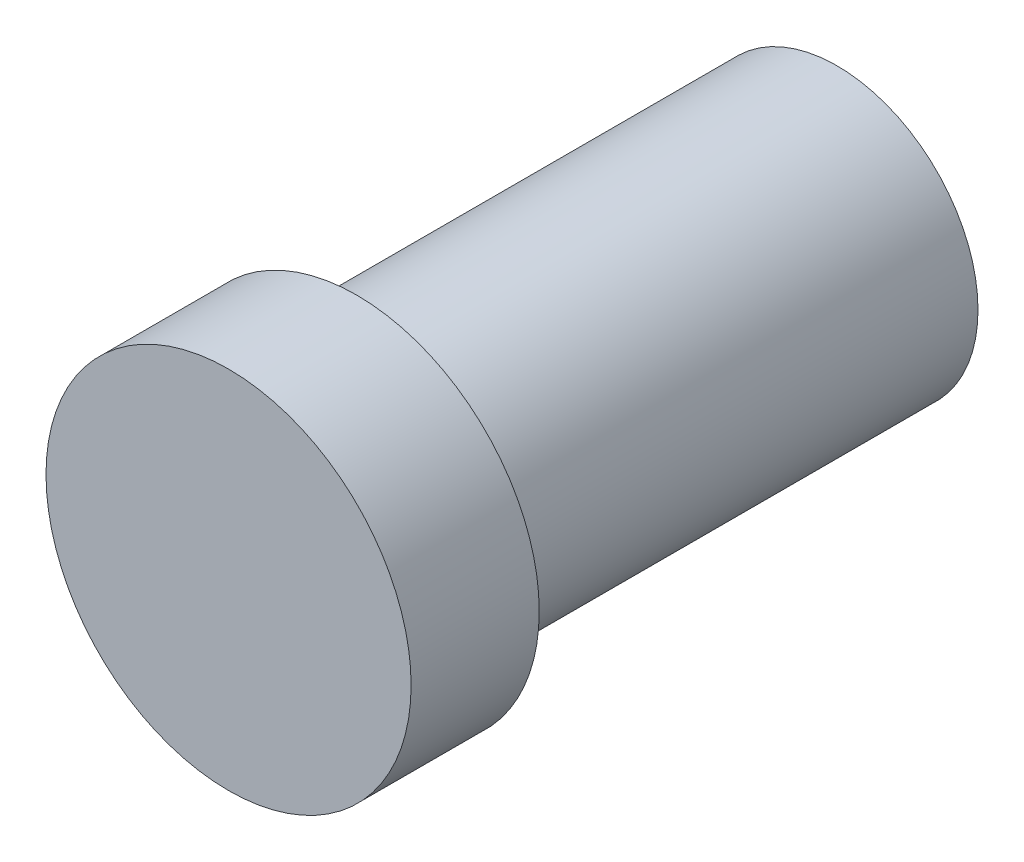
ISO-10303-21;
HEADER;
FILE_DESCRIPTION(('STEP AP214'),'2;1');
FILE_NAME('part.step','',(''),(''),'','','');
FILE_SCHEMA(('AUTOMOTIVE_DESIGN { 1 0 10303 214 1 1 1 1 }'));
ENDSEC;
DATA;
#1=APPLICATION_CONTEXT('core data for automotive mechanical design processes');
#2=APPLICATION_PROTOCOL_DEFINITION('international standard','automotive_design',2000,#1);
#3=PRODUCT_CONTEXT('',#1,'mechanical');
#4=PRODUCT('Part','Part','',(#3));
#5=PRODUCT_RELATED_PRODUCT_CATEGORY('part','',(#4));
#6=PRODUCT_DEFINITION_FORMATION('','',#4);
#7=PRODUCT_DEFINITION_CONTEXT('part definition',#1,'design');
#8=PRODUCT_DEFINITION('design','',#6,#7);
#9=PRODUCT_DEFINITION_SHAPE('','',#8);
#10=(LENGTH_UNIT() NAMED_UNIT(*) SI_UNIT(.MILLI.,.METRE.));
#11=(NAMED_UNIT(*) PLANE_ANGLE_UNIT() SI_UNIT($,.RADIAN.));
#12=(NAMED_UNIT(*) SI_UNIT($,.STERADIAN.) SOLID_ANGLE_UNIT());
#13=UNCERTAINTY_MEASURE_WITH_UNIT(LENGTH_MEASURE(1.E-05),#10,'distance_accuracy_value','');
#14=(GEOMETRIC_REPRESENTATION_CONTEXT(3) GLOBAL_UNCERTAINTY_ASSIGNED_CONTEXT((#13)) GLOBAL_UNIT_ASSIGNED_CONTEXT((#10,
#11,#12)) REPRESENTATION_CONTEXT('',''));
#15=CARTESIAN_POINT('',(0.,0.,0.));
#16=DIRECTION('',(0.,0.,1.));
#17=DIRECTION('',(1.,0.,0.));
#18=AXIS2_PLACEMENT_3D('',#15,#16,#17);
#19=CARTESIAN_POINT('',(0.,0.,75.));
#20=DIRECTION('',(0.,0.,-1.));
#21=DIRECTION('',(-1.,0.,0.));
#22=AXIS2_PLACEMENT_3D('',#19,#20,#21);
#23=CYLINDRICAL_SURFACE('',#22,22.);
#24=CARTESIAN_POINT('',(0.,0.,75.));
#25=DIRECTION('',(0.,0.,1.));
#26=DIRECTION('',(1.,0.,0.));
#27=AXIS2_PLACEMENT_3D('',#24,#25,#26);
#28=CIRCLE('',#27,22.);
#29=CARTESIAN_POINT('',(22.,0.,75.));
#30=VERTEX_POINT('',#29);
#31=EDGE_CURVE('E10',#30,#30,#28,.T.);
#32=ORIENTED_EDGE('',*,*,#31,.F.);
#33=EDGE_LOOP('',(#32));
#34=FACE_BOUND('',#33,.T.);
#35=CARTESIAN_POINT('',(0.,0.,0.));
#36=DIRECTION('',(0.,0.,1.));
#37=DIRECTION('',(1.,0.,0.));
#38=AXIS2_PLACEMENT_3D('',#35,#36,#37);
#39=CIRCLE('',#38,22.);
#40=CARTESIAN_POINT('',(22.,0.,0.));
#41=VERTEX_POINT('',#40);
#42=EDGE_CURVE('E34',#41,#41,#39,.T.);
#43=ORIENTED_EDGE('',*,*,#42,.T.);
#44=EDGE_LOOP('',(#43));
#45=FACE_BOUND('',#44,.T.);
#46=ADVANCED_FACE('F31',(#34,#45),#23,.T.);
#47=CARTESIAN_POINT('',(0.,0.,0.));
#48=DIRECTION('',(0.,0.,1.));
#49=DIRECTION('',(1.,0.,0.));
#50=AXIS2_PLACEMENT_3D('',#47,#48,#49);
#51=PLANE('',#50);
#52=ORIENTED_EDGE('',*,*,#42,.F.);
#53=EDGE_LOOP('',(#52));
#54=FACE_BOUND('',#53,.T.);
#55=ADVANCED_FACE('F54',(#54),#51,.F.);
#56=CARTESIAN_POINT('',(0.,0.,95.));
#57=DIRECTION('',(0.,0.,-1.));
#58=DIRECTION('',(-1.,0.,0.));
#59=AXIS2_PLACEMENT_3D('',#56,#57,#58);
#60=CYLINDRICAL_SURFACE('',#59,28.5);
#61=CARTESIAN_POINT('',(0.,0.,95.));
#62=DIRECTION('',(0.,0.,1.));
#63=DIRECTION('',(1.,0.,0.));
#64=AXIS2_PLACEMENT_3D('',#61,#62,#63);
#65=CIRCLE('',#64,28.5);
#66=CARTESIAN_POINT('',(28.5,0.,95.));
#67=VERTEX_POINT('',#66);
#68=EDGE_CURVE('E41',#67,#67,#65,.T.);
#69=ORIENTED_EDGE('',*,*,#68,.F.);
#70=EDGE_LOOP('',(#69));
#71=FACE_BOUND('',#70,.T.);
#72=CARTESIAN_POINT('',(0.,0.,75.));
#73=DIRECTION('',(0.,0.,1.));
#74=DIRECTION('',(1.,0.,0.));
#75=AXIS2_PLACEMENT_3D('',#72,#73,#74);
#76=CIRCLE('',#75,28.5);
#77=CARTESIAN_POINT('',(28.5,0.,75.));
#78=VERTEX_POINT('',#77);
#79=EDGE_CURVE('E43',#78,#78,#76,.T.);
#80=ORIENTED_EDGE('',*,*,#79,.T.);
#81=EDGE_LOOP('',(#80));
#82=FACE_BOUND('',#81,.T.);
#83=ADVANCED_FACE('F51',(#71,#82),#60,.T.);
#84=CARTESIAN_POINT('',(0.,0.,95.));
#85=DIRECTION('',(0.,0.,1.));
#86=DIRECTION('',(1.,0.,0.));
#87=AXIS2_PLACEMENT_3D('',#84,#85,#86);
#88=PLANE('',#87);
#89=ORIENTED_EDGE('',*,*,#68,.T.);
#90=EDGE_LOOP('',(#89));
#91=FACE_BOUND('',#90,.T.);
#92=ADVANCED_FACE('F49',(#91),#88,.T.);
#93=CARTESIAN_POINT('',(0.,0.,75.));
#94=DIRECTION('',(0.,0.,1.));
#95=DIRECTION('',(1.,0.,0.));
#96=AXIS2_PLACEMENT_3D('',#93,#94,#95);
#97=PLANE('',#96);
#98=ORIENTED_EDGE('',*,*,#31,.T.);
#99=EDGE_LOOP('',(#98));
#100=FACE_BOUND('',#99,.T.);
#101=ORIENTED_EDGE('',*,*,#79,.F.);
#102=EDGE_LOOP('',(#101));
#103=FACE_BOUND('',#102,.T.);
#104=ADVANCED_FACE('F58',(#100,#103),#97,.F.);
#105=CLOSED_SHELL('',(#46,#55,#83,#92,#104));
#106=MANIFOLD_SOLID_BREP('B2',#105);
#107=ADVANCED_BREP_SHAPE_REPRESENTATION('',(#18,#106),#14);
#108=SHAPE_DEFINITION_REPRESENTATION(#9,#107);
ENDSEC;
END-ISO-10303-21;
